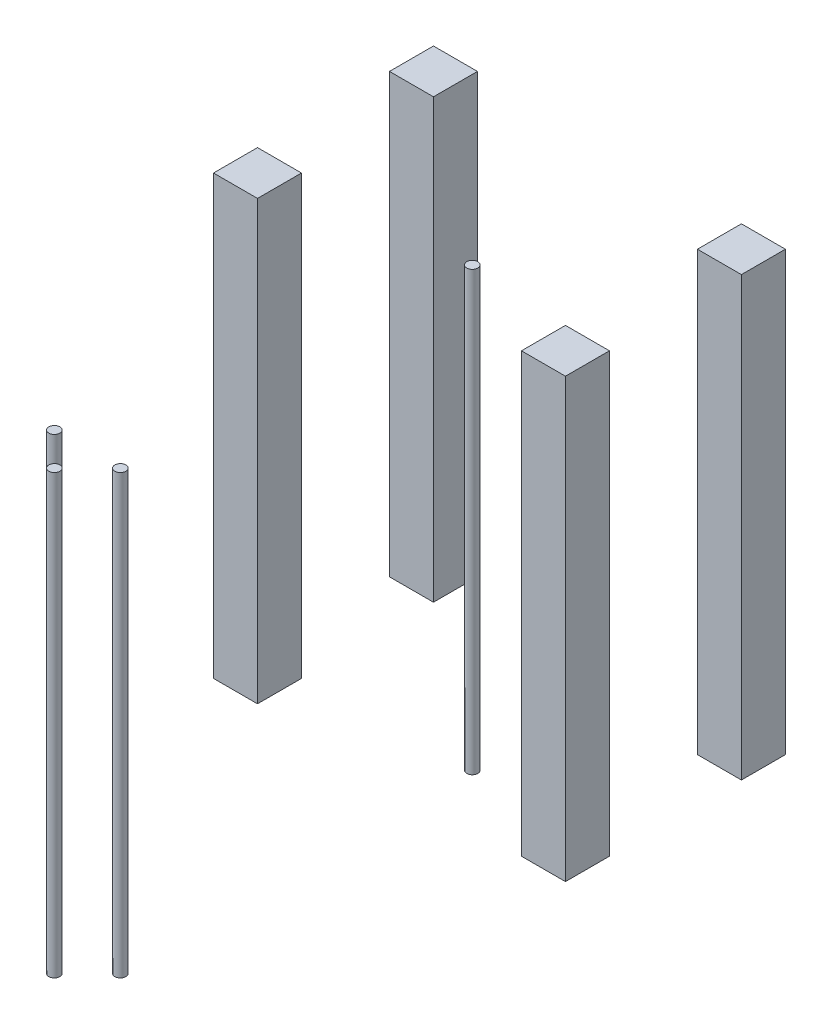
ISO-10303-21;
HEADER;
FILE_DESCRIPTION(('STEP AP214'),'2;1');
FILE_NAME('part.step','',(''),(''),'','','');
FILE_SCHEMA(('AUTOMOTIVE_DESIGN { 1 0 10303 214 1 1 1 1 }'));
ENDSEC;
DATA;
#1=APPLICATION_CONTEXT('core data for automotive mechanical design processes');
#2=APPLICATION_PROTOCOL_DEFINITION('international standard','automotive_design',2000,#1);
#3=PRODUCT_CONTEXT('',#1,'mechanical');
#4=PRODUCT('Part','Part','',(#3));
#5=PRODUCT_RELATED_PRODUCT_CATEGORY('part','',(#4));
#6=PRODUCT_DEFINITION_FORMATION('','',#4);
#7=PRODUCT_DEFINITION_CONTEXT('part definition',#1,'design');
#8=PRODUCT_DEFINITION('design','',#6,#7);
#9=PRODUCT_DEFINITION_SHAPE('','',#8);
#10=(LENGTH_UNIT() NAMED_UNIT(*) SI_UNIT(.MILLI.,.METRE.));
#11=(NAMED_UNIT(*) PLANE_ANGLE_UNIT() SI_UNIT($,.RADIAN.));
#12=(NAMED_UNIT(*) SI_UNIT($,.STERADIAN.) SOLID_ANGLE_UNIT());
#13=UNCERTAINTY_MEASURE_WITH_UNIT(LENGTH_MEASURE(1.E-05),#10,'distance_accuracy_value','');
#14=(GEOMETRIC_REPRESENTATION_CONTEXT(3) GLOBAL_UNCERTAINTY_ASSIGNED_CONTEXT((#13)) GLOBAL_UNIT_ASSIGNED_CONTEXT((#10,
#11,#12)) REPRESENTATION_CONTEXT('',''));
#15=CARTESIAN_POINT('',(0.,0.,0.));
#16=DIRECTION('',(0.,0.,1.));
#17=DIRECTION('',(1.,0.,0.));
#18=AXIS2_PLACEMENT_3D('',#15,#16,#17);
#19=CARTESIAN_POINT('',(14.9999999999996,199.,270.));
#20=DIRECTION('',(0.,-1.,0.));
#21=DIRECTION('',(0.,0.,-1.));
#22=AXIS2_PLACEMENT_3D('',#19,#20,#21);
#23=CYLINDRICAL_SURFACE('',#22,2.5);
#24=CARTESIAN_POINT('',(14.9999999999996,199.,270.));
#25=DIRECTION('',(0.,1.,0.));
#26=DIRECTION('',(0.,0.,1.));
#27=AXIS2_PLACEMENT_3D('',#24,#25,#26);
#28=CIRCLE('',#27,2.5);
#29=CARTESIAN_POINT('',(14.9999999999996,199.,272.5));
#30=VERTEX_POINT('',#29);
#31=EDGE_CURVE('E50',#30,#30,#28,.T.);
#32=ORIENTED_EDGE('',*,*,#31,.F.);
#33=EDGE_LOOP('',(#32));
#34=FACE_BOUND('',#33,.T.);
#35=CARTESIAN_POINT('',(14.9999999999996,0.,270.));
#36=DIRECTION('',(0.,1.,0.));
#37=DIRECTION('',(0.,0.,1.));
#38=AXIS2_PLACEMENT_3D('',#35,#36,#37);
#39=CIRCLE('',#38,2.5);
#40=CARTESIAN_POINT('',(14.9999999999996,0.,272.5));
#41=VERTEX_POINT('',#40);
#42=EDGE_CURVE('E11',#41,#41,#39,.T.);
#43=ORIENTED_EDGE('',*,*,#42,.T.);
#44=EDGE_LOOP('',(#43));
#45=FACE_BOUND('',#44,.T.);
#46=ADVANCED_FACE('F46',(#34,#45),#23,.T.);
#47=CARTESIAN_POINT('',(14.9999999999996,199.,270.));
#48=DIRECTION('',(0.,1.,0.));
#49=DIRECTION('',(0.,0.,1.));
#50=AXIS2_PLACEMENT_3D('',#47,#48,#49);
#51=PLANE('',#50);
#52=ORIENTED_EDGE('',*,*,#31,.T.);
#53=EDGE_LOOP('',(#52));
#54=FACE_BOUND('',#53,.T.);
#55=ADVANCED_FACE('F48',(#54),#51,.T.);
#56=CARTESIAN_POINT('',(14.9999999999996,0.,270.));
#57=DIRECTION('',(0.,1.,0.));
#58=DIRECTION('',(0.,0.,1.));
#59=AXIS2_PLACEMENT_3D('',#56,#57,#58);
#60=PLANE('',#59);
#61=ORIENTED_EDGE('',*,*,#42,.F.);
#62=EDGE_LOOP('',(#61));
#63=FACE_BOUND('',#62,.T.);
#64=ADVANCED_FACE('F65',(#63),#60,.F.);
#65=CLOSED_SHELL('',(#46,#55,#64));
#66=MANIFOLD_SOLID_BREP('B2',#65);
#67=CARTESIAN_POINT('',(3.33066907387547E-13,199.,285.));
#68=DIRECTION('',(0.,-1.,0.));
#69=DIRECTION('',(0.,0.,-1.));
#70=AXIS2_PLACEMENT_3D('',#67,#68,#69);
#71=CYLINDRICAL_SURFACE('',#70,2.5);
#72=CARTESIAN_POINT('',(3.33066907387547E-13,199.,285.));
#73=DIRECTION('',(0.,1.,0.));
#74=DIRECTION('',(0.,0.,1.));
#75=AXIS2_PLACEMENT_3D('',#72,#73,#74);
#76=CIRCLE('',#75,2.5);
#77=CARTESIAN_POINT('',(3.33066907387547E-13,199.,287.5));
#78=VERTEX_POINT('',#77);
#79=EDGE_CURVE('E99',#78,#78,#76,.T.);
#80=ORIENTED_EDGE('',*,*,#79,.F.);
#81=EDGE_LOOP('',(#80));
#82=FACE_BOUND('',#81,.T.);
#83=CARTESIAN_POINT('',(3.33066907387547E-13,0.,285.));
#84=DIRECTION('',(0.,1.,0.));
#85=DIRECTION('',(0.,0.,1.));
#86=AXIS2_PLACEMENT_3D('',#83,#84,#85);
#87=CIRCLE('',#86,2.5);
#88=CARTESIAN_POINT('',(3.33066907387547E-13,0.,287.5));
#89=VERTEX_POINT('',#88);
#90=EDGE_CURVE('E45',#89,#89,#87,.T.);
#91=ORIENTED_EDGE('',*,*,#90,.T.);
#92=EDGE_LOOP('',(#91));
#93=FACE_BOUND('',#92,.T.);
#94=ADVANCED_FACE('F95',(#82,#93),#71,.T.);
#95=CARTESIAN_POINT('',(3.33066907387547E-13,199.,285.));
#96=DIRECTION('',(0.,1.,0.));
#97=DIRECTION('',(0.,0.,1.));
#98=AXIS2_PLACEMENT_3D('',#95,#96,#97);
#99=PLANE('',#98);
#100=ORIENTED_EDGE('',*,*,#79,.T.);
#101=EDGE_LOOP('',(#100));
#102=FACE_BOUND('',#101,.T.);
#103=ADVANCED_FACE('F97',(#102),#99,.T.);
#104=CARTESIAN_POINT('',(3.33066907387547E-13,0.,285.));
#105=DIRECTION('',(0.,1.,0.));
#106=DIRECTION('',(0.,0.,1.));
#107=AXIS2_PLACEMENT_3D('',#104,#105,#106);
#108=PLANE('',#107);
#109=ORIENTED_EDGE('',*,*,#90,.F.);
#110=EDGE_LOOP('',(#109));
#111=FACE_BOUND('',#110,.T.);
#112=ADVANCED_FACE('F114',(#111),#108,.F.);
#113=CLOSED_SHELL('',(#94,#103,#112));
#114=MANIFOLD_SOLID_BREP('B6',#113);
#115=CARTESIAN_POINT('',(-14.9999999999996,199.,270.));
#116=DIRECTION('',(0.,-1.,0.));
#117=DIRECTION('',(0.,0.,-1.));
#118=AXIS2_PLACEMENT_3D('',#115,#116,#117);
#119=CYLINDRICAL_SURFACE('',#118,2.5);
#120=CARTESIAN_POINT('',(-14.9999999999996,199.,270.));
#121=DIRECTION('',(0.,1.,0.));
#122=DIRECTION('',(0.,0.,1.));
#123=AXIS2_PLACEMENT_3D('',#120,#121,#122);
#124=CIRCLE('',#123,2.5);
#125=CARTESIAN_POINT('',(-14.9999999999996,199.,272.5));
#126=VERTEX_POINT('',#125);
#127=EDGE_CURVE('E148',#126,#126,#124,.T.);
#128=ORIENTED_EDGE('',*,*,#127,.F.);
#129=EDGE_LOOP('',(#128));
#130=FACE_BOUND('',#129,.T.);
#131=CARTESIAN_POINT('',(-14.9999999999996,0.,270.));
#132=DIRECTION('',(0.,1.,0.));
#133=DIRECTION('',(0.,0.,1.));
#134=AXIS2_PLACEMENT_3D('',#131,#132,#133);
#135=CIRCLE('',#134,2.5);
#136=CARTESIAN_POINT('',(-14.9999999999996,0.,272.5));
#137=VERTEX_POINT('',#136);
#138=EDGE_CURVE('E94',#137,#137,#135,.T.);
#139=ORIENTED_EDGE('',*,*,#138,.T.);
#140=EDGE_LOOP('',(#139));
#141=FACE_BOUND('',#140,.T.);
#142=ADVANCED_FACE('F144',(#130,#141),#119,.T.);
#143=CARTESIAN_POINT('',(-14.9999999999996,199.,270.));
#144=DIRECTION('',(0.,1.,0.));
#145=DIRECTION('',(0.,0.,1.));
#146=AXIS2_PLACEMENT_3D('',#143,#144,#145);
#147=PLANE('',#146);
#148=ORIENTED_EDGE('',*,*,#127,.T.);
#149=EDGE_LOOP('',(#148));
#150=FACE_BOUND('',#149,.T.);
#151=ADVANCED_FACE('F146',(#150),#147,.T.);
#152=CARTESIAN_POINT('',(-14.9999999999996,0.,270.));
#153=DIRECTION('',(0.,1.,0.));
#154=DIRECTION('',(0.,0.,1.));
#155=AXIS2_PLACEMENT_3D('',#152,#153,#154);
#156=PLANE('',#155);
#157=ORIENTED_EDGE('',*,*,#138,.F.);
#158=EDGE_LOOP('',(#157));
#159=FACE_BOUND('',#158,.T.);
#160=ADVANCED_FACE('F163',(#159),#156,.F.);
#161=CLOSED_SHELL('',(#142,#151,#160));
#162=MANIFOLD_SOLID_BREP('B40',#161);
#163=CARTESIAN_POINT('',(15.0000000000004,199.,110.));
#164=DIRECTION('',(0.,-1.,0.));
#165=DIRECTION('',(0.,0.,-1.));
#166=AXIS2_PLACEMENT_3D('',#163,#164,#165);
#167=CYLINDRICAL_SURFACE('',#166,2.5);
#168=CARTESIAN_POINT('',(15.0000000000004,199.,110.));
#169=DIRECTION('',(0.,1.,0.));
#170=DIRECTION('',(0.,0.,1.));
#171=AXIS2_PLACEMENT_3D('',#168,#169,#170);
#172=CIRCLE('',#171,2.5);
#173=CARTESIAN_POINT('',(15.0000000000004,199.,112.5));
#174=VERTEX_POINT('',#173);
#175=EDGE_CURVE('E199',#174,#174,#172,.T.);
#176=ORIENTED_EDGE('',*,*,#175,.F.);
#177=EDGE_LOOP('',(#176));
#178=FACE_BOUND('',#177,.T.);
#179=CARTESIAN_POINT('',(15.0000000000004,0.,110.));
#180=DIRECTION('',(0.,1.,0.));
#181=DIRECTION('',(0.,0.,1.));
#182=AXIS2_PLACEMENT_3D('',#179,#180,#181);
#183=CIRCLE('',#182,2.5);
#184=CARTESIAN_POINT('',(15.0000000000004,0.,112.5));
#185=VERTEX_POINT('',#184);
#186=EDGE_CURVE('E143',#185,#185,#183,.T.);
#187=ORIENTED_EDGE('',*,*,#186,.T.);
#188=EDGE_LOOP('',(#187));
#189=FACE_BOUND('',#188,.T.);
#190=ADVANCED_FACE('F195',(#178,#189),#167,.T.);
#191=CARTESIAN_POINT('',(15.0000000000004,199.,110.));
#192=DIRECTION('',(0.,1.,0.));
#193=DIRECTION('',(0.,0.,1.));
#194=AXIS2_PLACEMENT_3D('',#191,#192,#193);
#195=PLANE('',#194);
#196=ORIENTED_EDGE('',*,*,#175,.T.);
#197=EDGE_LOOP('',(#196));
#198=FACE_BOUND('',#197,.T.);
#199=ADVANCED_FACE('F197',(#198),#195,.T.);
#200=CARTESIAN_POINT('',(15.0000000000004,0.,110.));
#201=DIRECTION('',(0.,1.,0.));
#202=DIRECTION('',(0.,0.,1.));
#203=AXIS2_PLACEMENT_3D('',#200,#201,#202);
#204=PLANE('',#203);
#205=ORIENTED_EDGE('',*,*,#186,.F.);
#206=EDGE_LOOP('',(#205));
#207=FACE_BOUND('',#206,.T.);
#208=ADVANCED_FACE('F214',(#207),#204,.F.);
#209=CLOSED_SHELL('',(#190,#199,#208));
#210=MANIFOLD_SOLID_BREP('B89',#209);
#211=CARTESIAN_POINT('',(-80.,199.,112.65));
#212=DIRECTION('',(1.,0.,0.));
#213=DIRECTION('',(0.,0.,-1.));
#214=AXIS2_PLACEMENT_3D('',#211,#212,#213);
#215=PLANE('',#214);
#216=DIRECTION('',(0.,0.,1.));
#217=VECTOR('',#216,1.);
#218=CARTESIAN_POINT('',(-80.,0.,112.65));
#219=LINE('',#218,#217);
#220=CARTESIAN_POINT('',(-80.,0.,112.65));
#221=VERTEX_POINT('',#220);
#222=CARTESIAN_POINT('',(-80.,0.,132.65));
#223=VERTEX_POINT('',#222);
#224=EDGE_CURVE('E193',#221,#223,#219,.T.);
#225=ORIENTED_EDGE('',*,*,#224,.T.);
#226=DIRECTION('',(0.,-1.,0.));
#227=VECTOR('',#226,1.);
#228=CARTESIAN_POINT('',(-80.,199.,132.65));
#229=LINE('',#228,#227);
#230=CARTESIAN_POINT('',(-80.,199.,132.65));
#231=VERTEX_POINT('',#230);
#232=EDGE_CURVE('E317',#231,#223,#229,.T.);
#233=ORIENTED_EDGE('',*,*,#232,.F.);
#234=DIRECTION('',(0.,0.,1.));
#235=VECTOR('',#234,1.);
#236=CARTESIAN_POINT('',(-80.,199.,112.65));
#237=LINE('',#236,#235);
#238=CARTESIAN_POINT('',(-80.,199.,112.65));
#239=VERTEX_POINT('',#238);
#240=EDGE_CURVE('E250',#239,#231,#237,.T.);
#241=ORIENTED_EDGE('',*,*,#240,.F.);
#242=DIRECTION('',(0.,-1.,0.));
#243=VECTOR('',#242,1.);
#244=CARTESIAN_POINT('',(-80.,199.,112.65));
#245=LINE('',#244,#243);
#246=EDGE_CURVE('E305',#239,#221,#245,.T.);
#247=ORIENTED_EDGE('',*,*,#246,.T.);
#248=EDGE_LOOP('',(#225,#233,#241,#247));
#249=FACE_BOUND('',#248,.T.);
#250=ADVANCED_FACE('F246',(#249),#215,.F.);
#251=CARTESIAN_POINT('',(-80.,199.,132.65));
#252=DIRECTION('',(0.,0.,-1.));
#253=DIRECTION('',(-1.,0.,0.));
#254=AXIS2_PLACEMENT_3D('',#251,#252,#253);
#255=PLANE('',#254);
#256=DIRECTION('',(1.,0.,0.));
#257=VECTOR('',#256,1.);
#258=CARTESIAN_POINT('',(-80.,0.,132.65));
#259=LINE('',#258,#257);
#260=CARTESIAN_POINT('',(-60.,0.,132.65));
#261=VERTEX_POINT('',#260);
#262=EDGE_CURVE('E256',#223,#261,#259,.T.);
#263=ORIENTED_EDGE('',*,*,#262,.T.);
#264=DIRECTION('',(0.,-1.,0.));
#265=VECTOR('',#264,1.);
#266=CARTESIAN_POINT('',(-60.,199.,132.65));
#267=LINE('',#266,#265);
#268=CARTESIAN_POINT('',(-60.,199.,132.65));
#269=VERTEX_POINT('',#268);
#270=EDGE_CURVE('E301',#269,#261,#267,.T.);
#271=ORIENTED_EDGE('',*,*,#270,.F.);
#272=DIRECTION('',(1.,0.,0.));
#273=VECTOR('',#272,1.);
#274=CARTESIAN_POINT('',(-80.,199.,132.65));
#275=LINE('',#274,#273);
#276=EDGE_CURVE('E280',#231,#269,#275,.T.);
#277=ORIENTED_EDGE('',*,*,#276,.F.);
#278=ORIENTED_EDGE('',*,*,#232,.T.);
#279=EDGE_LOOP('',(#263,#271,#277,#278));
#280=FACE_BOUND('',#279,.T.);
#281=ADVANCED_FACE('F320',(#280),#255,.F.);
#282=CARTESIAN_POINT('',(-60.,199.,112.65));
#283=DIRECTION('',(-1.,0.,0.));
#284=DIRECTION('',(0.,0.,1.));
#285=AXIS2_PLACEMENT_3D('',#282,#283,#284);
#286=PLANE('',#285);
#287=DIRECTION('',(0.,0.,-1.));
#288=VECTOR('',#287,1.);
#289=CARTESIAN_POINT('',(-60.,0.,112.65));
#290=LINE('',#289,#288);
#291=CARTESIAN_POINT('',(-60.,0.,112.65));
#292=VERTEX_POINT('',#291);
#293=EDGE_CURVE('E296',#261,#292,#290,.T.);
#294=ORIENTED_EDGE('',*,*,#293,.T.);
#295=DIRECTION('',(0.,-1.,0.));
#296=VECTOR('',#295,1.);
#297=CARTESIAN_POINT('',(-60.,199.,112.65));
#298=LINE('',#297,#296);
#299=CARTESIAN_POINT('',(-60.,199.,112.65));
#300=VERTEX_POINT('',#299);
#301=EDGE_CURVE('E299',#300,#292,#298,.T.);
#302=ORIENTED_EDGE('',*,*,#301,.F.);
#303=DIRECTION('',(0.,0.,-1.));
#304=VECTOR('',#303,1.);
#305=CARTESIAN_POINT('',(-60.,199.,112.65));
#306=LINE('',#305,#304);
#307=EDGE_CURVE('E313',#269,#300,#306,.T.);
#308=ORIENTED_EDGE('',*,*,#307,.F.);
#309=ORIENTED_EDGE('',*,*,#270,.T.);
#310=EDGE_LOOP('',(#294,#302,#308,#309));
#311=FACE_BOUND('',#310,.T.);
#312=ADVANCED_FACE('F297',(#311),#286,.F.);
#313=CARTESIAN_POINT('',(-80.,199.,112.65));
#314=DIRECTION('',(0.,0.,1.));
#315=DIRECTION('',(1.,0.,0.));
#316=AXIS2_PLACEMENT_3D('',#313,#314,#315);
#317=PLANE('',#316);
#318=DIRECTION('',(-1.,0.,0.));
#319=VECTOR('',#318,1.);
#320=CARTESIAN_POINT('',(-80.,0.,112.65));
#321=LINE('',#320,#319);
#322=EDGE_CURVE('E290',#292,#221,#321,.T.);
#323=ORIENTED_EDGE('',*,*,#322,.T.);
#324=ORIENTED_EDGE('',*,*,#246,.F.);
#325=DIRECTION('',(-1.,0.,0.));
#326=VECTOR('',#325,1.);
#327=CARTESIAN_POINT('',(-80.,199.,112.65));
#328=LINE('',#327,#326);
#329=EDGE_CURVE('E304',#300,#239,#328,.T.);
#330=ORIENTED_EDGE('',*,*,#329,.F.);
#331=ORIENTED_EDGE('',*,*,#301,.T.);
#332=EDGE_LOOP('',(#323,#324,#330,#331));
#333=FACE_BOUND('',#332,.T.);
#334=ADVANCED_FACE('F303',(#333),#317,.F.);
#335=CARTESIAN_POINT('',(0.,199.,0.));
#336=DIRECTION('',(0.,1.,0.));
#337=DIRECTION('',(0.,0.,1.));
#338=AXIS2_PLACEMENT_3D('',#335,#336,#337);
#339=PLANE('',#338);
#340=ORIENTED_EDGE('',*,*,#240,.T.);
#341=ORIENTED_EDGE('',*,*,#276,.T.);
#342=ORIENTED_EDGE('',*,*,#307,.T.);
#343=ORIENTED_EDGE('',*,*,#329,.T.);
#344=EDGE_LOOP('',(#340,#341,#342,#343));
#345=FACE_BOUND('',#344,.T.);
#346=ADVANCED_FACE('F248',(#345),#339,.T.);
#347=CARTESIAN_POINT('',(0.,0.,0.));
#348=DIRECTION('',(0.,1.,0.));
#349=DIRECTION('',(0.,0.,1.));
#350=AXIS2_PLACEMENT_3D('',#347,#348,#349);
#351=PLANE('',#350);
#352=ORIENTED_EDGE('',*,*,#224,.F.);
#353=ORIENTED_EDGE('',*,*,#322,.F.);
#354=ORIENTED_EDGE('',*,*,#293,.F.);
#355=ORIENTED_EDGE('',*,*,#262,.F.);
#356=EDGE_LOOP('',(#352,#353,#354,#355));
#357=FACE_BOUND('',#356,.T.);
#358=ADVANCED_FACE('F307',(#357),#351,.F.);
#359=CLOSED_SHELL('',(#250,#281,#312,#334,#346,#358));
#360=MANIFOLD_SOLID_BREP('B138',#359);
#361=CARTESIAN_POINT('',(60.,199.,112.65));
#362=DIRECTION('',(1.,0.,0.));
#363=DIRECTION('',(0.,0.,-1.));
#364=AXIS2_PLACEMENT_3D('',#361,#362,#363);
#365=PLANE('',#364);
#366=DIRECTION('',(0.,0.,1.));
#367=VECTOR('',#366,1.);
#368=CARTESIAN_POINT('',(60.,0.,112.65));
#369=LINE('',#368,#367);
#370=CARTESIAN_POINT('',(60.,0.,112.65));
#371=VERTEX_POINT('',#370);
#372=CARTESIAN_POINT('',(60.,0.,132.65));
#373=VERTEX_POINT('',#372);
#374=EDGE_CURVE('E244',#371,#373,#369,.T.);
#375=ORIENTED_EDGE('',*,*,#374,.T.);
#376=DIRECTION('',(0.,-1.,0.));
#377=VECTOR('',#376,1.);
#378=CARTESIAN_POINT('',(60.,199.,132.65));
#379=LINE('',#378,#377);
#380=CARTESIAN_POINT('',(60.,199.,132.65));
#381=VERTEX_POINT('',#380);
#382=EDGE_CURVE('E451',#381,#373,#379,.T.);
#383=ORIENTED_EDGE('',*,*,#382,.F.);
#384=DIRECTION('',(0.,0.,1.));
#385=VECTOR('',#384,1.);
#386=CARTESIAN_POINT('',(60.,199.,112.65));
#387=LINE('',#386,#385);
#388=CARTESIAN_POINT('',(60.,199.,112.65));
#389=VERTEX_POINT('',#388);
#390=EDGE_CURVE('E384',#389,#381,#387,.T.);
#391=ORIENTED_EDGE('',*,*,#390,.F.);
#392=DIRECTION('',(0.,-1.,0.));
#393=VECTOR('',#392,1.);
#394=CARTESIAN_POINT('',(60.,199.,112.65));
#395=LINE('',#394,#393);
#396=EDGE_CURVE('E439',#389,#371,#395,.T.);
#397=ORIENTED_EDGE('',*,*,#396,.T.);
#398=EDGE_LOOP('',(#375,#383,#391,#397));
#399=FACE_BOUND('',#398,.T.);
#400=ADVANCED_FACE('F380',(#399),#365,.F.);
#401=CARTESIAN_POINT('',(60.,199.,132.65));
#402=DIRECTION('',(0.,0.,-1.));
#403=DIRECTION('',(-1.,0.,0.));
#404=AXIS2_PLACEMENT_3D('',#401,#402,#403);
#405=PLANE('',#404);
#406=DIRECTION('',(1.,0.,0.));
#407=VECTOR('',#406,1.);
#408=CARTESIAN_POINT('',(60.,0.,132.65));
#409=LINE('',#408,#407);
#410=CARTESIAN_POINT('',(80.,0.,132.65));
#411=VERTEX_POINT('',#410);
#412=EDGE_CURVE('E390',#373,#411,#409,.T.);
#413=ORIENTED_EDGE('',*,*,#412,.T.);
#414=DIRECTION('',(0.,-1.,0.));
#415=VECTOR('',#414,1.);
#416=CARTESIAN_POINT('',(80.,199.,132.65));
#417=LINE('',#416,#415);
#418=CARTESIAN_POINT('',(80.,199.,132.65));
#419=VERTEX_POINT('',#418);
#420=EDGE_CURVE('E435',#419,#411,#417,.T.);
#421=ORIENTED_EDGE('',*,*,#420,.F.);
#422=DIRECTION('',(1.,0.,0.));
#423=VECTOR('',#422,1.);
#424=CARTESIAN_POINT('',(60.,199.,132.65));
#425=LINE('',#424,#423);
#426=EDGE_CURVE('E414',#381,#419,#425,.T.);
#427=ORIENTED_EDGE('',*,*,#426,.F.);
#428=ORIENTED_EDGE('',*,*,#382,.T.);
#429=EDGE_LOOP('',(#413,#421,#427,#428));
#430=FACE_BOUND('',#429,.T.);
#431=ADVANCED_FACE('F454',(#430),#405,.F.);
#432=CARTESIAN_POINT('',(80.,199.,112.65));
#433=DIRECTION('',(-1.,0.,0.));
#434=DIRECTION('',(0.,0.,1.));
#435=AXIS2_PLACEMENT_3D('',#432,#433,#434);
#436=PLANE('',#435);
#437=DIRECTION('',(0.,0.,-1.));
#438=VECTOR('',#437,1.);
#439=CARTESIAN_POINT('',(80.,0.,112.65));
#440=LINE('',#439,#438);
#441=CARTESIAN_POINT('',(80.,0.,112.65));
#442=VERTEX_POINT('',#441);
#443=EDGE_CURVE('E430',#411,#442,#440,.T.);
#444=ORIENTED_EDGE('',*,*,#443,.T.);
#445=DIRECTION('',(0.,-1.,0.));
#446=VECTOR('',#445,1.);
#447=CARTESIAN_POINT('',(80.,199.,112.65));
#448=LINE('',#447,#446);
#449=CARTESIAN_POINT('',(80.,199.,112.65));
#450=VERTEX_POINT('',#449);
#451=EDGE_CURVE('E433',#450,#442,#448,.T.);
#452=ORIENTED_EDGE('',*,*,#451,.F.);
#453=DIRECTION('',(0.,0.,-1.));
#454=VECTOR('',#453,1.);
#455=CARTESIAN_POINT('',(80.,199.,112.65));
#456=LINE('',#455,#454);
#457=EDGE_CURVE('E447',#419,#450,#456,.T.);
#458=ORIENTED_EDGE('',*,*,#457,.F.);
#459=ORIENTED_EDGE('',*,*,#420,.T.);
#460=EDGE_LOOP('',(#444,#452,#458,#459));
#461=FACE_BOUND('',#460,.T.);
#462=ADVANCED_FACE('F431',(#461),#436,.F.);
#463=CARTESIAN_POINT('',(60.,199.,112.65));
#464=DIRECTION('',(0.,0.,1.));
#465=DIRECTION('',(1.,0.,0.));
#466=AXIS2_PLACEMENT_3D('',#463,#464,#465);
#467=PLANE('',#466);
#468=DIRECTION('',(-1.,0.,0.));
#469=VECTOR('',#468,1.);
#470=CARTESIAN_POINT('',(60.,0.,112.65));
#471=LINE('',#470,#469);
#472=EDGE_CURVE('E424',#442,#371,#471,.T.);
#473=ORIENTED_EDGE('',*,*,#472,.T.);
#474=ORIENTED_EDGE('',*,*,#396,.F.);
#475=DIRECTION('',(-1.,0.,0.));
#476=VECTOR('',#475,1.);
#477=CARTESIAN_POINT('',(60.,199.,112.65));
#478=LINE('',#477,#476);
#479=EDGE_CURVE('E438',#450,#389,#478,.T.);
#480=ORIENTED_EDGE('',*,*,#479,.F.);
#481=ORIENTED_EDGE('',*,*,#451,.T.);
#482=EDGE_LOOP('',(#473,#474,#480,#481));
#483=FACE_BOUND('',#482,.T.);
#484=ADVANCED_FACE('F437',(#483),#467,.F.);
#485=CARTESIAN_POINT('',(0.,199.,0.));
#486=DIRECTION('',(0.,1.,0.));
#487=DIRECTION('',(0.,0.,1.));
#488=AXIS2_PLACEMENT_3D('',#485,#486,#487);
#489=PLANE('',#488);
#490=ORIENTED_EDGE('',*,*,#390,.T.);
#491=ORIENTED_EDGE('',*,*,#426,.T.);
#492=ORIENTED_EDGE('',*,*,#457,.T.);
#493=ORIENTED_EDGE('',*,*,#479,.T.);
#494=EDGE_LOOP('',(#490,#491,#492,#493));
#495=FACE_BOUND('',#494,.T.);
#496=ADVANCED_FACE('F382',(#495),#489,.T.);
#497=CARTESIAN_POINT('',(0.,0.,0.));
#498=DIRECTION('',(0.,1.,0.));
#499=DIRECTION('',(0.,0.,1.));
#500=AXIS2_PLACEMENT_3D('',#497,#498,#499);
#501=PLANE('',#500);
#502=ORIENTED_EDGE('',*,*,#374,.F.);
#503=ORIENTED_EDGE('',*,*,#472,.F.);
#504=ORIENTED_EDGE('',*,*,#443,.F.);
#505=ORIENTED_EDGE('',*,*,#412,.F.);
#506=EDGE_LOOP('',(#502,#503,#504,#505));
#507=FACE_BOUND('',#506,.T.);
#508=ADVANCED_FACE('F441',(#507),#501,.F.);
#509=CLOSED_SHELL('',(#400,#431,#462,#484,#496,#508));
#510=MANIFOLD_SOLID_BREP('B187',#509);
#511=CARTESIAN_POINT('',(60.,199.,32.65));
#512=DIRECTION('',(1.,0.,0.));
#513=DIRECTION('',(0.,0.,-1.));
#514=AXIS2_PLACEMENT_3D('',#511,#512,#513);
#515=PLANE('',#514);
#516=DIRECTION('',(0.,0.,1.));
#517=VECTOR('',#516,1.);
#518=CARTESIAN_POINT('',(60.,0.,32.65));
#519=LINE('',#518,#517);
#520=CARTESIAN_POINT('',(60.,0.,32.65));
#521=VERTEX_POINT('',#520);
#522=CARTESIAN_POINT('',(60.,0.,52.65));
#523=VERTEX_POINT('',#522);
#524=EDGE_CURVE('E378',#521,#523,#519,.T.);
#525=ORIENTED_EDGE('',*,*,#524,.T.);
#526=DIRECTION('',(0.,-1.,0.));
#527=VECTOR('',#526,1.);
#528=CARTESIAN_POINT('',(60.,199.,52.65));
#529=LINE('',#528,#527);
#530=CARTESIAN_POINT('',(60.,199.,52.65));
#531=VERTEX_POINT('',#530);
#532=EDGE_CURVE('E584',#531,#523,#529,.T.);
#533=ORIENTED_EDGE('',*,*,#532,.F.);
#534=DIRECTION('',(0.,0.,1.));
#535=VECTOR('',#534,1.);
#536=CARTESIAN_POINT('',(60.,199.,32.65));
#537=LINE('',#536,#535);
#538=CARTESIAN_POINT('',(60.,199.,32.65));
#539=VERTEX_POINT('',#538);
#540=EDGE_CURVE('E517',#539,#531,#537,.T.);
#541=ORIENTED_EDGE('',*,*,#540,.F.);
#542=DIRECTION('',(0.,-1.,0.));
#543=VECTOR('',#542,1.);
#544=CARTESIAN_POINT('',(60.,199.,32.65));
#545=LINE('',#544,#543);
#546=EDGE_CURVE('E572',#539,#521,#545,.T.);
#547=ORIENTED_EDGE('',*,*,#546,.T.);
#548=EDGE_LOOP('',(#525,#533,#541,#547));
#549=FACE_BOUND('',#548,.T.);
#550=ADVANCED_FACE('F513',(#549),#515,.F.);
#551=CARTESIAN_POINT('',(60.,199.,52.65));
#552=DIRECTION('',(0.,0.,-1.));
#553=DIRECTION('',(-1.,0.,0.));
#554=AXIS2_PLACEMENT_3D('',#551,#552,#553);
#555=PLANE('',#554);
#556=DIRECTION('',(1.,0.,0.));
#557=VECTOR('',#556,1.);
#558=CARTESIAN_POINT('',(60.,0.,52.65));
#559=LINE('',#558,#557);
#560=CARTESIAN_POINT('',(80.,0.,52.65));
#561=VERTEX_POINT('',#560);
#562=EDGE_CURVE('E523',#523,#561,#559,.T.);
#563=ORIENTED_EDGE('',*,*,#562,.T.);
#564=DIRECTION('',(0.,-1.,0.));
#565=VECTOR('',#564,1.);
#566=CARTESIAN_POINT('',(80.,199.,52.65));
#567=LINE('',#566,#565);
#568=CARTESIAN_POINT('',(80.,199.,52.65));
#569=VERTEX_POINT('',#568);
#570=EDGE_CURVE('E568',#569,#561,#567,.T.);
#571=ORIENTED_EDGE('',*,*,#570,.F.);
#572=DIRECTION('',(1.,0.,0.));
#573=VECTOR('',#572,1.);
#574=CARTESIAN_POINT('',(60.,199.,52.65));
#575=LINE('',#574,#573);
#576=EDGE_CURVE('E547',#531,#569,#575,.T.);
#577=ORIENTED_EDGE('',*,*,#576,.F.);
#578=ORIENTED_EDGE('',*,*,#532,.T.);
#579=EDGE_LOOP('',(#563,#571,#577,#578));
#580=FACE_BOUND('',#579,.T.);
#581=ADVANCED_FACE('F587',(#580),#555,.F.);
#582=CARTESIAN_POINT('',(80.,199.,32.65));
#583=DIRECTION('',(-1.,0.,0.));
#584=DIRECTION('',(0.,0.,1.));
#585=AXIS2_PLACEMENT_3D('',#582,#583,#584);
#586=PLANE('',#585);
#587=DIRECTION('',(0.,0.,-1.));
#588=VECTOR('',#587,1.);
#589=CARTESIAN_POINT('',(80.,0.,32.65));
#590=LINE('',#589,#588);
#591=CARTESIAN_POINT('',(80.,0.,32.65));
#592=VERTEX_POINT('',#591);
#593=EDGE_CURVE('E563',#561,#592,#590,.T.);
#594=ORIENTED_EDGE('',*,*,#593,.T.);
#595=DIRECTION('',(0.,-1.,0.));
#596=VECTOR('',#595,1.);
#597=CARTESIAN_POINT('',(80.,199.,32.65));
#598=LINE('',#597,#596);
#599=CARTESIAN_POINT('',(80.,199.,32.65));
#600=VERTEX_POINT('',#599);
#601=EDGE_CURVE('E566',#600,#592,#598,.T.);
#602=ORIENTED_EDGE('',*,*,#601,.F.);
#603=DIRECTION('',(0.,0.,-1.));
#604=VECTOR('',#603,1.);
#605=CARTESIAN_POINT('',(80.,199.,32.65));
#606=LINE('',#605,#604);
#607=EDGE_CURVE('E580',#569,#600,#606,.T.);
#608=ORIENTED_EDGE('',*,*,#607,.F.);
#609=ORIENTED_EDGE('',*,*,#570,.T.);
#610=EDGE_LOOP('',(#594,#602,#608,#609));
#611=FACE_BOUND('',#610,.T.);
#612=ADVANCED_FACE('F564',(#611),#586,.F.);
#613=CARTESIAN_POINT('',(60.,199.,32.65));
#614=DIRECTION('',(0.,0.,1.));
#615=DIRECTION('',(1.,0.,0.));
#616=AXIS2_PLACEMENT_3D('',#613,#614,#615);
#617=PLANE('',#616);
#618=DIRECTION('',(-1.,0.,0.));
#619=VECTOR('',#618,1.);
#620=CARTESIAN_POINT('',(60.,0.,32.65));
#621=LINE('',#620,#619);
#622=EDGE_CURVE('E557',#592,#521,#621,.T.);
#623=ORIENTED_EDGE('',*,*,#622,.T.);
#624=ORIENTED_EDGE('',*,*,#546,.F.);
#625=DIRECTION('',(-1.,0.,0.));
#626=VECTOR('',#625,1.);
#627=CARTESIAN_POINT('',(60.,199.,32.65));
#628=LINE('',#627,#626);
#629=EDGE_CURVE('E571',#600,#539,#628,.T.);
#630=ORIENTED_EDGE('',*,*,#629,.F.);
#631=ORIENTED_EDGE('',*,*,#601,.T.);
#632=EDGE_LOOP('',(#623,#624,#630,#631));
#633=FACE_BOUND('',#632,.T.);
#634=ADVANCED_FACE('F570',(#633),#617,.F.);
#635=CARTESIAN_POINT('',(0.,199.,0.));
#636=DIRECTION('',(0.,1.,0.));
#637=DIRECTION('',(0.,0.,1.));
#638=AXIS2_PLACEMENT_3D('',#635,#636,#637);
#639=PLANE('',#638);
#640=ORIENTED_EDGE('',*,*,#540,.T.);
#641=ORIENTED_EDGE('',*,*,#576,.T.);
#642=ORIENTED_EDGE('',*,*,#607,.T.);
#643=ORIENTED_EDGE('',*,*,#629,.T.);
#644=EDGE_LOOP('',(#640,#641,#642,#643));
#645=FACE_BOUND('',#644,.T.);
#646=ADVANCED_FACE('F515',(#645),#639,.T.);
#647=CARTESIAN_POINT('',(0.,0.,0.));
#648=DIRECTION('',(0.,1.,0.));
#649=DIRECTION('',(0.,0.,1.));
#650=AXIS2_PLACEMENT_3D('',#647,#648,#649);
#651=PLANE('',#650);
#652=ORIENTED_EDGE('',*,*,#524,.F.);
#653=ORIENTED_EDGE('',*,*,#622,.F.);
#654=ORIENTED_EDGE('',*,*,#593,.F.);
#655=ORIENTED_EDGE('',*,*,#562,.F.);
#656=EDGE_LOOP('',(#652,#653,#654,#655));
#657=FACE_BOUND('',#656,.T.);
#658=ADVANCED_FACE('F574',(#657),#651,.F.);
#659=CLOSED_SHELL('',(#550,#581,#612,#634,#646,#658));
#660=MANIFOLD_SOLID_BREP('B238',#659);
#661=CARTESIAN_POINT('',(-80.,199.,32.65));
#662=DIRECTION('',(1.,0.,0.));
#663=DIRECTION('',(0.,0.,-1.));
#664=AXIS2_PLACEMENT_3D('',#661,#662,#663);
#665=PLANE('',#664);
#666=DIRECTION('',(0.,0.,1.));
#667=VECTOR('',#666,1.);
#668=CARTESIAN_POINT('',(-80.,0.,32.65));
#669=LINE('',#668,#667);
#670=CARTESIAN_POINT('',(-80.,0.,32.65));
#671=VERTEX_POINT('',#670);
#672=CARTESIAN_POINT('',(-80.,0.,52.65));
#673=VERTEX_POINT('',#672);
#674=EDGE_CURVE('E700',#671,#673,#669,.T.);
#675=ORIENTED_EDGE('',*,*,#674,.T.);
#676=DIRECTION('',(0.,-1.,0.));
#677=VECTOR('',#676,1.);
#678=CARTESIAN_POINT('',(-80.,199.,52.65));
#679=LINE('',#678,#677);
#680=CARTESIAN_POINT('',(-80.,199.,52.65));
#681=VERTEX_POINT('',#680);
#682=EDGE_CURVE('E511',#681,#673,#679,.T.);
#683=ORIENTED_EDGE('',*,*,#682,.F.);
#684=DIRECTION('',(0.,0.,1.));
#685=VECTOR('',#684,1.);
#686=CARTESIAN_POINT('',(-80.,199.,32.65));
#687=LINE('',#686,#685);
#688=CARTESIAN_POINT('',(-80.,199.,32.65));
#689=VERTEX_POINT('',#688);
#690=EDGE_CURVE('E688',#689,#681,#687,.T.);
#691=ORIENTED_EDGE('',*,*,#690,.F.);
#692=DIRECTION('',(0.,-1.,0.));
#693=VECTOR('',#692,1.);
#694=CARTESIAN_POINT('',(-80.,199.,32.65));
#695=LINE('',#694,#693);
#696=EDGE_CURVE('E696',#689,#671,#695,.T.);
#697=ORIENTED_EDGE('',*,*,#696,.T.);
#698=EDGE_LOOP('',(#675,#683,#691,#697));
#699=FACE_BOUND('',#698,.T.);
#700=ADVANCED_FACE('F637',(#699),#665,.F.);
#701=CARTESIAN_POINT('',(-80.,199.,52.65));
#702=DIRECTION('',(0.,0.,-1.));
#703=DIRECTION('',(-1.,0.,0.));
#704=AXIS2_PLACEMENT_3D('',#701,#702,#703);
#705=PLANE('',#704);
#706=DIRECTION('',(1.,0.,0.));
#707=VECTOR('',#706,1.);
#708=CARTESIAN_POINT('',(-80.,0.,52.65));
#709=LINE('',#708,#707);
#710=CARTESIAN_POINT('',(-60.,0.,52.65));
#711=VERTEX_POINT('',#710);
#712=EDGE_CURVE('E692',#673,#711,#709,.T.);
#713=ORIENTED_EDGE('',*,*,#712,.T.);
#714=DIRECTION('',(0.,-1.,0.));
#715=VECTOR('',#714,1.);
#716=CARTESIAN_POINT('',(-60.,199.,52.65));
#717=LINE('',#716,#715);
#718=CARTESIAN_POINT('',(-60.,199.,52.65));
#719=VERTEX_POINT('',#718);
#720=EDGE_CURVE('E645',#719,#711,#717,.T.);
#721=ORIENTED_EDGE('',*,*,#720,.F.);
#722=DIRECTION('',(1.,0.,0.));
#723=VECTOR('',#722,1.);
#724=CARTESIAN_POINT('',(-80.,199.,52.65));
#725=LINE('',#724,#723);
#726=EDGE_CURVE('E683',#681,#719,#725,.T.);
#727=ORIENTED_EDGE('',*,*,#726,.F.);
#728=ORIENTED_EDGE('',*,*,#682,.T.);
#729=EDGE_LOOP('',(#713,#721,#727,#728));
#730=FACE_BOUND('',#729,.T.);
#731=ADVANCED_FACE('F691',(#730),#705,.F.);
#732=CARTESIAN_POINT('',(-60.,199.,32.65));
#733=DIRECTION('',(-1.,0.,0.));
#734=DIRECTION('',(0.,0.,1.));
#735=AXIS2_PLACEMENT_3D('',#732,#733,#734);
#736=PLANE('',#735);
#737=DIRECTION('',(0.,0.,-1.));
#738=VECTOR('',#737,1.);
#739=CARTESIAN_POINT('',(-60.,0.,32.65));
#740=LINE('',#739,#738);
#741=CARTESIAN_POINT('',(-60.,0.,32.65));
#742=VERTEX_POINT('',#741);
#743=EDGE_CURVE('E670',#711,#742,#740,.T.);
#744=ORIENTED_EDGE('',*,*,#743,.T.);
#745=DIRECTION('',(0.,-1.,0.));
#746=VECTOR('',#745,1.);
#747=CARTESIAN_POINT('',(-60.,199.,32.65));
#748=LINE('',#747,#746);
#749=CARTESIAN_POINT('',(-60.,199.,32.65));
#750=VERTEX_POINT('',#749);
#751=EDGE_CURVE('E693',#750,#742,#748,.T.);
#752=ORIENTED_EDGE('',*,*,#751,.F.);
#753=DIRECTION('',(0.,0.,-1.));
#754=VECTOR('',#753,1.);
#755=CARTESIAN_POINT('',(-60.,199.,32.65));
#756=LINE('',#755,#754);
#757=EDGE_CURVE('E686',#719,#750,#756,.T.);
#758=ORIENTED_EDGE('',*,*,#757,.F.);
#759=ORIENTED_EDGE('',*,*,#720,.T.);
#760=EDGE_LOOP('',(#744,#752,#758,#759));
#761=FACE_BOUND('',#760,.T.);
#762=ADVANCED_FACE('F694',(#761),#736,.F.);
#763=CARTESIAN_POINT('',(-80.,199.,32.65));
#764=DIRECTION('',(0.,0.,1.));
#765=DIRECTION('',(1.,0.,0.));
#766=AXIS2_PLACEMENT_3D('',#763,#764,#765);
#767=PLANE('',#766);
#768=DIRECTION('',(-1.,0.,0.));
#769=VECTOR('',#768,1.);
#770=CARTESIAN_POINT('',(-80.,0.,32.65));
#771=LINE('',#770,#769);
#772=EDGE_CURVE('E676',#742,#671,#771,.T.);
#773=ORIENTED_EDGE('',*,*,#772,.T.);
#774=ORIENTED_EDGE('',*,*,#696,.F.);
#775=DIRECTION('',(-1.,0.,0.));
#776=VECTOR('',#775,1.);
#777=CARTESIAN_POINT('',(-80.,199.,32.65));
#778=LINE('',#777,#776);
#779=EDGE_CURVE('E653',#750,#689,#778,.T.);
#780=ORIENTED_EDGE('',*,*,#779,.F.);
#781=ORIENTED_EDGE('',*,*,#751,.T.);
#782=EDGE_LOOP('',(#773,#774,#780,#781));
#783=FACE_BOUND('',#782,.T.);
#784=ADVANCED_FACE('F707',(#783),#767,.F.);
#785=CARTESIAN_POINT('',(0.,199.,0.));
#786=DIRECTION('',(0.,1.,0.));
#787=DIRECTION('',(0.,0.,1.));
#788=AXIS2_PLACEMENT_3D('',#785,#786,#787);
#789=PLANE('',#788);
#790=ORIENTED_EDGE('',*,*,#690,.T.);
#791=ORIENTED_EDGE('',*,*,#726,.T.);
#792=ORIENTED_EDGE('',*,*,#757,.T.);
#793=ORIENTED_EDGE('',*,*,#779,.T.);
#794=EDGE_LOOP('',(#790,#791,#792,#793));
#795=FACE_BOUND('',#794,.T.);
#796=ADVANCED_FACE('F684',(#795),#789,.T.);
#797=CARTESIAN_POINT('',(0.,0.,0.));
#798=DIRECTION('',(0.,1.,0.));
#799=DIRECTION('',(0.,0.,1.));
#800=AXIS2_PLACEMENT_3D('',#797,#798,#799);
#801=PLANE('',#800);
#802=ORIENTED_EDGE('',*,*,#674,.F.);
#803=ORIENTED_EDGE('',*,*,#772,.F.);
#804=ORIENTED_EDGE('',*,*,#743,.F.);
#805=ORIENTED_EDGE('',*,*,#712,.F.);
#806=EDGE_LOOP('',(#802,#803,#804,#805));
#807=FACE_BOUND('',#806,.T.);
#808=ADVANCED_FACE('F710',(#807),#801,.F.);
#809=CLOSED_SHELL('',(#700,#731,#762,#784,#796,#808));
#810=MANIFOLD_SOLID_BREP('B372',#809);
#811=ADVANCED_BREP_SHAPE_REPRESENTATION('',(#18,#66,#114,#162,#210,#360,#510,#660,#810),#14);
#812=SHAPE_DEFINITION_REPRESENTATION(#9,#811);
ENDSEC;
END-ISO-10303-21;
